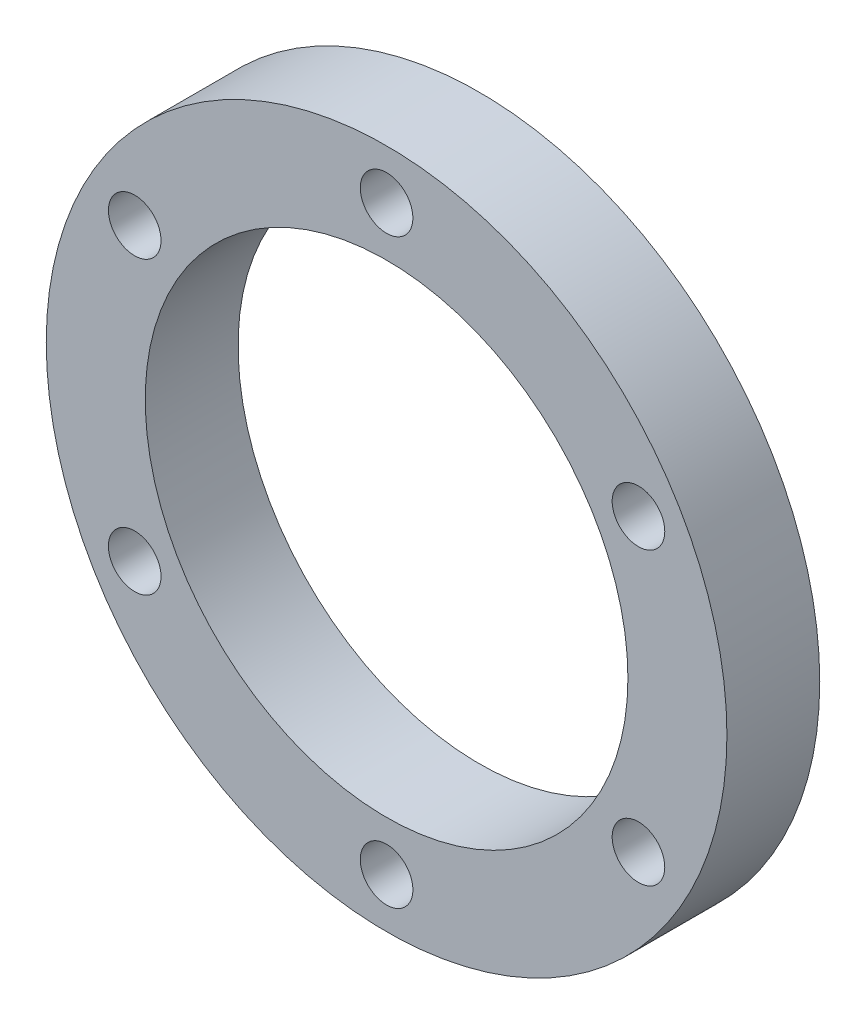
ISO-10303-21;
HEADER;
FILE_DESCRIPTION(('STEP AP214'),'2;1');
FILE_NAME('part.step','',(''),(''),'','','');
FILE_SCHEMA(('AUTOMOTIVE_DESIGN { 1 0 10303 214 1 1 1 1 }'));
ENDSEC;
DATA;
#1=APPLICATION_CONTEXT('core data for automotive mechanical design processes');
#2=APPLICATION_PROTOCOL_DEFINITION('international standard','automotive_design',2000,#1);
#3=PRODUCT_CONTEXT('',#1,'mechanical');
#4=PRODUCT('Part','Part','',(#3));
#5=PRODUCT_RELATED_PRODUCT_CATEGORY('part','',(#4));
#6=PRODUCT_DEFINITION_FORMATION('','',#4);
#7=PRODUCT_DEFINITION_CONTEXT('part definition',#1,'design');
#8=PRODUCT_DEFINITION('design','',#6,#7);
#9=PRODUCT_DEFINITION_SHAPE('','',#8);
#10=(LENGTH_UNIT() NAMED_UNIT(*) SI_UNIT(.MILLI.,.METRE.));
#11=(NAMED_UNIT(*) PLANE_ANGLE_UNIT() SI_UNIT($,.RADIAN.));
#12=(NAMED_UNIT(*) SI_UNIT($,.STERADIAN.) SOLID_ANGLE_UNIT());
#13=UNCERTAINTY_MEASURE_WITH_UNIT(LENGTH_MEASURE(1.E-05),#10,'distance_accuracy_value','');
#14=(GEOMETRIC_REPRESENTATION_CONTEXT(3) GLOBAL_UNCERTAINTY_ASSIGNED_CONTEXT((#13)) GLOBAL_UNIT_ASSIGNED_CONTEXT((#10,
#11,#12)) REPRESENTATION_CONTEXT('',''));
#15=CARTESIAN_POINT('',(0.,0.,0.));
#16=DIRECTION('',(0.,0.,1.));
#17=DIRECTION('',(1.,0.,0.));
#18=AXIS2_PLACEMENT_3D('',#15,#16,#17);
#19=CARTESIAN_POINT('',(0.,0.,15.));
#20=DIRECTION('',(0.,0.,-1.));
#21=DIRECTION('',(-1.,0.,0.));
#22=AXIS2_PLACEMENT_3D('',#19,#20,#21);
#23=CYLINDRICAL_SURFACE('',#22,55.);
#24=CARTESIAN_POINT('',(0.,0.,15.));
#25=DIRECTION('',(0.,0.,1.));
#26=DIRECTION('',(1.,0.,0.));
#27=AXIS2_PLACEMENT_3D('',#24,#25,#26);
#28=CIRCLE('',#27,55.);
#29=CARTESIAN_POINT('',(55.,0.,15.));
#30=VERTEX_POINT('',#29);
#31=EDGE_CURVE('E10',#30,#30,#28,.T.);
#32=ORIENTED_EDGE('',*,*,#31,.F.);
#33=EDGE_LOOP('',(#32));
#34=FACE_BOUND('',#33,.T.);
#35=CARTESIAN_POINT('',(0.,0.,0.));
#36=DIRECTION('',(0.,0.,1.));
#37=DIRECTION('',(1.,0.,0.));
#38=AXIS2_PLACEMENT_3D('',#35,#36,#37);
#39=CIRCLE('',#38,55.);
#40=CARTESIAN_POINT('',(55.,0.,0.));
#41=VERTEX_POINT('',#40);
#42=EDGE_CURVE('E38',#41,#41,#39,.T.);
#43=ORIENTED_EDGE('',*,*,#42,.T.);
#44=EDGE_LOOP('',(#43));
#45=FACE_BOUND('',#44,.T.);
#46=ADVANCED_FACE('F35',(#34,#45),#23,.T.);
#47=CARTESIAN_POINT('',(0.,0.,15.));
#48=DIRECTION('',(0.,0.,1.));
#49=DIRECTION('',(1.,0.,0.));
#50=AXIS2_PLACEMENT_3D('',#47,#48,#49);
#51=PLANE('',#50);
#52=CARTESIAN_POINT('',(0.,0.,15.));
#53=DIRECTION('',(0.,0.,1.));
#54=DIRECTION('',(1.,0.,0.));
#55=AXIS2_PLACEMENT_3D('',#52,#53,#54);
#56=CIRCLE('',#55,39.);
#57=CARTESIAN_POINT('',(39.,0.,15.));
#58=VERTEX_POINT('',#57);
#59=EDGE_CURVE('E83',#58,#58,#56,.T.);
#60=ORIENTED_EDGE('',*,*,#59,.F.);
#61=EDGE_LOOP('',(#60));
#62=FACE_BOUND('',#61,.T.);
#63=CARTESIAN_POINT('',(-40.7031939778683,23.5000000000005,15.));
#64=DIRECTION('',(0.,0.,1.));
#65=DIRECTION('',(1.,0.,0.));
#66=AXIS2_PLACEMENT_3D('',#63,#64,#65);
#67=CIRCLE('',#66,4.25);
#68=CARTESIAN_POINT('',(-36.4531939778683,23.5000000000005,15.));
#69=VERTEX_POINT('',#68);
#70=EDGE_CURVE('E79',#69,#69,#67,.T.);
#71=ORIENTED_EDGE('',*,*,#70,.F.);
#72=EDGE_LOOP('',(#71));
#73=FACE_BOUND('',#72,.T.);
#74=CARTESIAN_POINT('',(-40.7031939778688,-23.4999999999996,15.));
#75=DIRECTION('',(0.,0.,1.));
#76=DIRECTION('',(1.,0.,0.));
#77=AXIS2_PLACEMENT_3D('',#74,#75,#76);
#78=CIRCLE('',#77,4.25);
#79=CARTESIAN_POINT('',(-36.4531939778688,-23.4999999999996,15.));
#80=VERTEX_POINT('',#79);
#81=EDGE_CURVE('E73',#80,#80,#78,.T.);
#82=ORIENTED_EDGE('',*,*,#81,.F.);
#83=EDGE_LOOP('',(#82));
#84=FACE_BOUND('',#83,.T.);
#85=CARTESIAN_POINT('',(0.,-47.,15.));
#86=DIRECTION('',(0.,0.,1.));
#87=DIRECTION('',(1.,0.,0.));
#88=AXIS2_PLACEMENT_3D('',#85,#86,#87);
#89=CIRCLE('',#88,4.25);
#90=CARTESIAN_POINT('',(4.25,-47.,15.));
#91=VERTEX_POINT('',#90);
#92=EDGE_CURVE('E67',#91,#91,#89,.T.);
#93=ORIENTED_EDGE('',*,*,#92,.F.);
#94=EDGE_LOOP('',(#93));
#95=FACE_BOUND('',#94,.T.);
#96=CARTESIAN_POINT('',(40.7031939778685,-23.5000000000002,15.));
#97=DIRECTION('',(0.,0.,1.));
#98=DIRECTION('',(1.,0.,0.));
#99=AXIS2_PLACEMENT_3D('',#96,#97,#98);
#100=CIRCLE('',#99,4.25);
#101=CARTESIAN_POINT('',(44.9531939778685,-23.5000000000002,15.));
#102=VERTEX_POINT('',#101);
#103=EDGE_CURVE('E61',#102,#102,#100,.T.);
#104=ORIENTED_EDGE('',*,*,#103,.F.);
#105=EDGE_LOOP('',(#104));
#106=FACE_BOUND('',#105,.T.);
#107=CARTESIAN_POINT('',(40.7031939778687,23.4999999999999,15.));
#108=DIRECTION('',(0.,0.,1.));
#109=DIRECTION('',(1.,0.,0.));
#110=AXIS2_PLACEMENT_3D('',#107,#108,#109);
#111=CIRCLE('',#110,4.25);
#112=CARTESIAN_POINT('',(44.9531939778687,23.4999999999999,15.));
#113=VERTEX_POINT('',#112);
#114=EDGE_CURVE('E55',#113,#113,#111,.T.);
#115=ORIENTED_EDGE('',*,*,#114,.F.);
#116=EDGE_LOOP('',(#115));
#117=FACE_BOUND('',#116,.T.);
#118=CARTESIAN_POINT('',(0.,47.,15.));
#119=DIRECTION('',(0.,0.,1.));
#120=DIRECTION('',(1.,0.,0.));
#121=AXIS2_PLACEMENT_3D('',#118,#119,#120);
#122=CIRCLE('',#121,4.25);
#123=CARTESIAN_POINT('',(4.25,47.,15.));
#124=VERTEX_POINT('',#123);
#125=EDGE_CURVE('E49',#124,#124,#122,.T.);
#126=ORIENTED_EDGE('',*,*,#125,.F.);
#127=EDGE_LOOP('',(#126));
#128=FACE_BOUND('',#127,.T.);
#129=ORIENTED_EDGE('',*,*,#31,.T.);
#130=EDGE_LOOP('',(#129));
#131=FACE_BOUND('',#130,.T.);
#132=ADVANCED_FACE('F99',(#62,#73,#84,#95,#106,#117,#128,#131),#51,.T.);
#133=CARTESIAN_POINT('',(0.,0.,0.));
#134=DIRECTION('',(0.,0.,1.));
#135=DIRECTION('',(1.,0.,0.));
#136=AXIS2_PLACEMENT_3D('',#133,#134,#135);
#137=PLANE('',#136);
#138=CARTESIAN_POINT('',(0.,0.,0.));
#139=DIRECTION('',(0.,0.,1.));
#140=DIRECTION('',(1.,0.,0.));
#141=AXIS2_PLACEMENT_3D('',#138,#139,#140);
#142=CIRCLE('',#141,39.);
#143=CARTESIAN_POINT('',(39.,0.,0.));
#144=VERTEX_POINT('',#143);
#145=EDGE_CURVE('E82',#144,#144,#142,.T.);
#146=ORIENTED_EDGE('',*,*,#145,.T.);
#147=EDGE_LOOP('',(#146));
#148=FACE_BOUND('',#147,.T.);
#149=CARTESIAN_POINT('',(-40.7031939778683,23.5000000000005,0.));
#150=DIRECTION('',(0.,0.,1.));
#151=DIRECTION('',(1.,0.,0.));
#152=AXIS2_PLACEMENT_3D('',#149,#150,#151);
#153=CIRCLE('',#152,4.25);
#154=CARTESIAN_POINT('',(-36.4531939778683,23.5000000000005,0.));
#155=VERTEX_POINT('',#154);
#156=EDGE_CURVE('E76',#155,#155,#153,.T.);
#157=ORIENTED_EDGE('',*,*,#156,.T.);
#158=EDGE_LOOP('',(#157));
#159=FACE_BOUND('',#158,.T.);
#160=CARTESIAN_POINT('',(-40.7031939778688,-23.4999999999996,0.));
#161=DIRECTION('',(0.,0.,1.));
#162=DIRECTION('',(1.,0.,0.));
#163=AXIS2_PLACEMENT_3D('',#160,#161,#162);
#164=CIRCLE('',#163,4.25);
#165=CARTESIAN_POINT('',(-36.4531939778688,-23.4999999999996,0.));
#166=VERTEX_POINT('',#165);
#167=EDGE_CURVE('E70',#166,#166,#164,.T.);
#168=ORIENTED_EDGE('',*,*,#167,.T.);
#169=EDGE_LOOP('',(#168));
#170=FACE_BOUND('',#169,.T.);
#171=CARTESIAN_POINT('',(0.,-47.,0.));
#172=DIRECTION('',(0.,0.,1.));
#173=DIRECTION('',(1.,0.,0.));
#174=AXIS2_PLACEMENT_3D('',#171,#172,#173);
#175=CIRCLE('',#174,4.25);
#176=CARTESIAN_POINT('',(4.25,-47.,0.));
#177=VERTEX_POINT('',#176);
#178=EDGE_CURVE('E64',#177,#177,#175,.T.);
#179=ORIENTED_EDGE('',*,*,#178,.T.);
#180=EDGE_LOOP('',(#179));
#181=FACE_BOUND('',#180,.T.);
#182=CARTESIAN_POINT('',(40.7031939778685,-23.5000000000002,0.));
#183=DIRECTION('',(0.,0.,1.));
#184=DIRECTION('',(1.,0.,0.));
#185=AXIS2_PLACEMENT_3D('',#182,#183,#184);
#186=CIRCLE('',#185,4.25);
#187=CARTESIAN_POINT('',(44.9531939778685,-23.5000000000002,0.));
#188=VERTEX_POINT('',#187);
#189=EDGE_CURVE('E58',#188,#188,#186,.T.);
#190=ORIENTED_EDGE('',*,*,#189,.T.);
#191=EDGE_LOOP('',(#190));
#192=FACE_BOUND('',#191,.T.);
#193=CARTESIAN_POINT('',(40.7031939778687,23.4999999999999,0.));
#194=DIRECTION('',(0.,0.,1.));
#195=DIRECTION('',(1.,0.,0.));
#196=AXIS2_PLACEMENT_3D('',#193,#194,#195);
#197=CIRCLE('',#196,4.25);
#198=CARTESIAN_POINT('',(44.9531939778687,23.4999999999999,0.));
#199=VERTEX_POINT('',#198);
#200=EDGE_CURVE('E52',#199,#199,#197,.T.);
#201=ORIENTED_EDGE('',*,*,#200,.T.);
#202=EDGE_LOOP('',(#201));
#203=FACE_BOUND('',#202,.T.);
#204=CARTESIAN_POINT('',(0.,47.,0.));
#205=DIRECTION('',(0.,0.,1.));
#206=DIRECTION('',(1.,0.,0.));
#207=AXIS2_PLACEMENT_3D('',#204,#205,#206);
#208=CIRCLE('',#207,4.25);
#209=CARTESIAN_POINT('',(4.25,47.,0.));
#210=VERTEX_POINT('',#209);
#211=EDGE_CURVE('E45',#210,#210,#208,.T.);
#212=ORIENTED_EDGE('',*,*,#211,.T.);
#213=EDGE_LOOP('',(#212));
#214=FACE_BOUND('',#213,.T.);
#215=ORIENTED_EDGE('',*,*,#42,.F.);
#216=EDGE_LOOP('',(#215));
#217=FACE_BOUND('',#216,.T.);
#218=ADVANCED_FACE('F89',(#148,#159,#170,#181,#192,#203,#214,#217),#137,.F.);
#219=CARTESIAN_POINT('',(0.,47.,15.));
#220=DIRECTION('',(0.,0.,1.));
#221=DIRECTION('',(1.,0.,0.));
#222=AXIS2_PLACEMENT_3D('',#219,#220,#221);
#223=CYLINDRICAL_SURFACE('',#222,4.25);
#224=ORIENTED_EDGE('',*,*,#211,.F.);
#225=EDGE_LOOP('',(#224));
#226=FACE_BOUND('',#225,.T.);
#227=ORIENTED_EDGE('',*,*,#125,.T.);
#228=EDGE_LOOP('',(#227));
#229=FACE_BOUND('',#228,.T.);
#230=ADVANCED_FACE('F115',(#226,#229),#223,.F.);
#231=CARTESIAN_POINT('',(40.7031939778687,23.4999999999999,15.));
#232=DIRECTION('',(0.,0.,1.));
#233=DIRECTION('',(1.,0.,0.));
#234=AXIS2_PLACEMENT_3D('',#231,#232,#233);
#235=CYLINDRICAL_SURFACE('',#234,4.25);
#236=ORIENTED_EDGE('',*,*,#200,.F.);
#237=EDGE_LOOP('',(#236));
#238=FACE_BOUND('',#237,.T.);
#239=ORIENTED_EDGE('',*,*,#114,.T.);
#240=EDGE_LOOP('',(#239));
#241=FACE_BOUND('',#240,.T.);
#242=ADVANCED_FACE('F117',(#238,#241),#235,.F.);
#243=CARTESIAN_POINT('',(40.7031939778685,-23.5000000000002,15.));
#244=DIRECTION('',(0.,0.,1.));
#245=DIRECTION('',(1.,0.,0.));
#246=AXIS2_PLACEMENT_3D('',#243,#244,#245);
#247=CYLINDRICAL_SURFACE('',#246,4.25);
#248=ORIENTED_EDGE('',*,*,#189,.F.);
#249=EDGE_LOOP('',(#248));
#250=FACE_BOUND('',#249,.T.);
#251=ORIENTED_EDGE('',*,*,#103,.T.);
#252=EDGE_LOOP('',(#251));
#253=FACE_BOUND('',#252,.T.);
#254=ADVANCED_FACE('F124',(#250,#253),#247,.F.);
#255=CARTESIAN_POINT('',(0.,-47.,15.));
#256=DIRECTION('',(0.,0.,1.));
#257=DIRECTION('',(1.,0.,0.));
#258=AXIS2_PLACEMENT_3D('',#255,#256,#257);
#259=CYLINDRICAL_SURFACE('',#258,4.25);
#260=ORIENTED_EDGE('',*,*,#178,.F.);
#261=EDGE_LOOP('',(#260));
#262=FACE_BOUND('',#261,.T.);
#263=ORIENTED_EDGE('',*,*,#92,.T.);
#264=EDGE_LOOP('',(#263));
#265=FACE_BOUND('',#264,.T.);
#266=ADVANCED_FACE('F169',(#262,#265),#259,.F.);
#267=CARTESIAN_POINT('',(-40.7031939778688,-23.4999999999996,15.));
#268=DIRECTION('',(0.,0.,1.));
#269=DIRECTION('',(1.,0.,0.));
#270=AXIS2_PLACEMENT_3D('',#267,#268,#269);
#271=CYLINDRICAL_SURFACE('',#270,4.25);
#272=ORIENTED_EDGE('',*,*,#167,.F.);
#273=EDGE_LOOP('',(#272));
#274=FACE_BOUND('',#273,.T.);
#275=ORIENTED_EDGE('',*,*,#81,.T.);
#276=EDGE_LOOP('',(#275));
#277=FACE_BOUND('',#276,.T.);
#278=ADVANCED_FACE('F161',(#274,#277),#271,.F.);
#279=CARTESIAN_POINT('',(-40.7031939778683,23.5000000000005,15.));
#280=DIRECTION('',(0.,0.,1.));
#281=DIRECTION('',(1.,0.,0.));
#282=AXIS2_PLACEMENT_3D('',#279,#280,#281);
#283=CYLINDRICAL_SURFACE('',#282,4.25);
#284=ORIENTED_EDGE('',*,*,#156,.F.);
#285=EDGE_LOOP('',(#284));
#286=FACE_BOUND('',#285,.T.);
#287=ORIENTED_EDGE('',*,*,#70,.T.);
#288=EDGE_LOOP('',(#287));
#289=FACE_BOUND('',#288,.T.);
#290=ADVANCED_FACE('F95',(#286,#289),#283,.F.);
#291=CARTESIAN_POINT('',(0.,0.,0.));
#292=DIRECTION('',(0.,0.,1.));
#293=DIRECTION('',(1.,0.,0.));
#294=AXIS2_PLACEMENT_3D('',#291,#292,#293);
#295=CYLINDRICAL_SURFACE('',#294,39.);
#296=ORIENTED_EDGE('',*,*,#145,.F.);
#297=EDGE_LOOP('',(#296));
#298=FACE_BOUND('',#297,.T.);
#299=ORIENTED_EDGE('',*,*,#59,.T.);
#300=EDGE_LOOP('',(#299));
#301=FACE_BOUND('',#300,.T.);
#302=ADVANCED_FACE('F92',(#298,#301),#295,.F.);
#303=CLOSED_SHELL('',(#46,#132,#218,#230,#242,#254,#266,#278,#290,#302));
#304=MANIFOLD_SOLID_BREP('B2',#303);
#305=ADVANCED_BREP_SHAPE_REPRESENTATION('',(#18,#304),#14);
#306=SHAPE_DEFINITION_REPRESENTATION(#9,#305);
ENDSEC;
END-ISO-10303-21;
